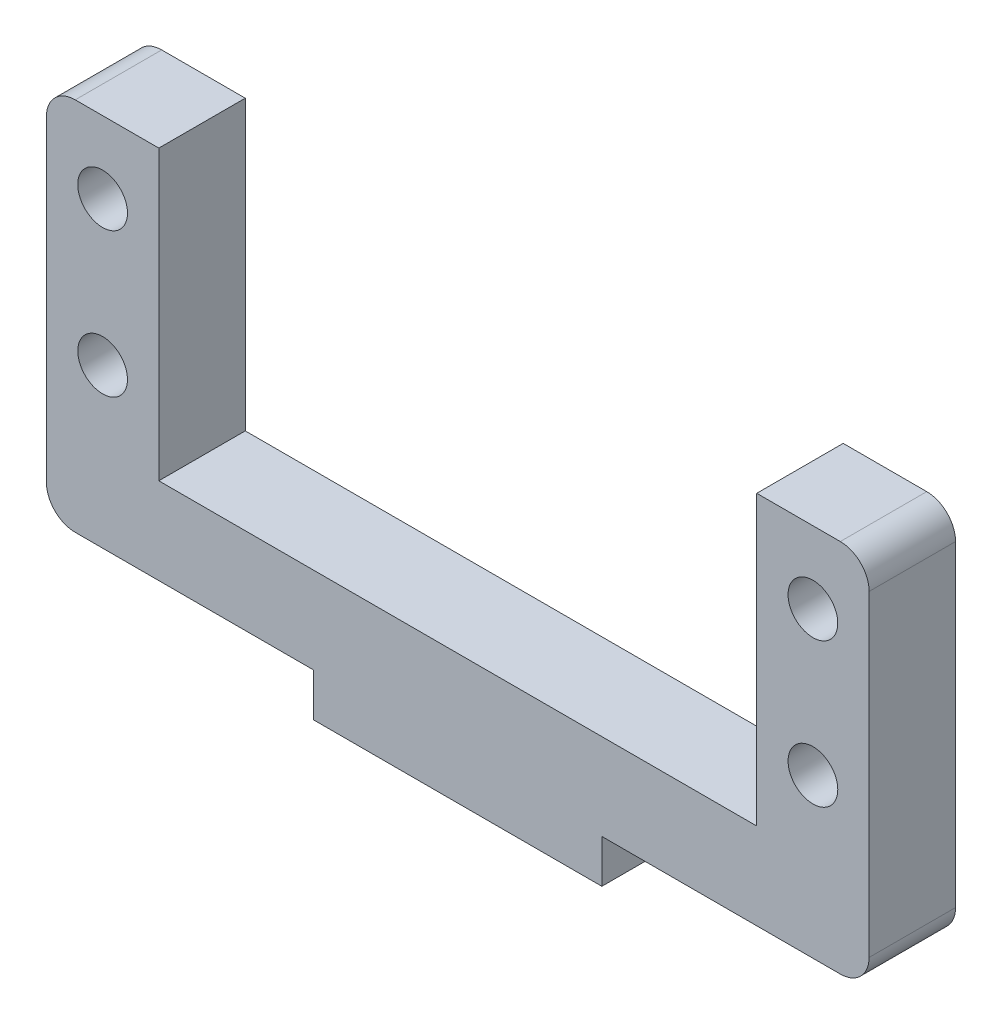
ISO-10303-21;
HEADER;
FILE_DESCRIPTION(('STEP AP214'),'2;1');
FILE_NAME('part.step','',(''),(''),'','','');
FILE_SCHEMA(('AUTOMOTIVE_DESIGN { 1 0 10303 214 1 1 1 1 }'));
ENDSEC;
DATA;
#1=APPLICATION_CONTEXT('core data for automotive mechanical design processes');
#2=APPLICATION_PROTOCOL_DEFINITION('international standard','automotive_design',2000,#1);
#3=PRODUCT_CONTEXT('',#1,'mechanical');
#4=PRODUCT('Part','Part','',(#3));
#5=PRODUCT_RELATED_PRODUCT_CATEGORY('part','',(#4));
#6=PRODUCT_DEFINITION_FORMATION('','',#4);
#7=PRODUCT_DEFINITION_CONTEXT('part definition',#1,'design');
#8=PRODUCT_DEFINITION('design','',#6,#7);
#9=PRODUCT_DEFINITION_SHAPE('','',#8);
#10=(LENGTH_UNIT() NAMED_UNIT(*) SI_UNIT(.MILLI.,.METRE.));
#11=(NAMED_UNIT(*) PLANE_ANGLE_UNIT() SI_UNIT($,.RADIAN.));
#12=(NAMED_UNIT(*) SI_UNIT($,.STERADIAN.) SOLID_ANGLE_UNIT());
#13=UNCERTAINTY_MEASURE_WITH_UNIT(LENGTH_MEASURE(1.E-05),#10,'distance_accuracy_value','');
#14=(GEOMETRIC_REPRESENTATION_CONTEXT(3) GLOBAL_UNCERTAINTY_ASSIGNED_CONTEXT((#13)) GLOBAL_UNIT_ASSIGNED_CONTEXT((#10,
#11,#12)) REPRESENTATION_CONTEXT('',''));
#15=CARTESIAN_POINT('',(0.,0.,0.));
#16=DIRECTION('',(0.,0.,1.));
#17=DIRECTION('',(1.,0.,0.));
#18=AXIS2_PLACEMENT_3D('',#15,#16,#17);
#19=CARTESIAN_POINT('',(0.,0.,6.));
#20=DIRECTION('',(0.,0.,1.));
#21=DIRECTION('',(1.,0.,0.));
#22=AXIS2_PLACEMENT_3D('',#19,#20,#21);
#23=PLANE('',#22);
#24=CARTESIAN_POINT('',(24.65,14.,6.));
#25=DIRECTION('',(0.,0.,1.));
#26=DIRECTION('',(1.,0.,0.));
#27=AXIS2_PLACEMENT_3D('',#24,#25,#26);
#28=CIRCLE('',#27,1.725);
#29=CARTESIAN_POINT('',(26.375,14.,6.));
#30=VERTEX_POINT('',#29);
#31=EDGE_CURVE('E299',#30,#30,#28,.T.);
#32=ORIENTED_EDGE('',*,*,#31,.F.);
#33=EDGE_LOOP('',(#32));
#34=FACE_BOUND('',#33,.T.);
#35=CARTESIAN_POINT('',(-24.65,24.,6.));
#36=DIRECTION('',(0.,0.,1.));
#37=DIRECTION('',(1.,0.,0.));
#38=AXIS2_PLACEMENT_3D('',#35,#36,#37);
#39=CIRCLE('',#38,1.725);
#40=CARTESIAN_POINT('',(-22.925,24.,6.));
#41=VERTEX_POINT('',#40);
#42=EDGE_CURVE('E274',#41,#41,#39,.T.);
#43=ORIENTED_EDGE('',*,*,#42,.F.);
#44=EDGE_LOOP('',(#43));
#45=FACE_BOUND('',#44,.T.);
#46=DIRECTION('',(-1.,0.,0.));
#47=VECTOR('',#46,1.);
#48=CARTESIAN_POINT('',(-28.55,29.,6.));
#49=LINE('',#48,#47);
#50=CARTESIAN_POINT('',(-20.75,29.,6.));
#51=VERTEX_POINT('',#50);
#52=CARTESIAN_POINT('',(-26.55,29.,6.));
#53=VERTEX_POINT('',#52);
#54=EDGE_CURVE('E278',#51,#53,#49,.T.);
#55=ORIENTED_EDGE('',*,*,#54,.T.);
#56=CARTESIAN_POINT('',(-26.55,27.,6.));
#57=DIRECTION('',(0.,0.,1.));
#58=DIRECTION('',(1.,0.,0.));
#59=AXIS2_PLACEMENT_3D('',#56,#57,#58);
#60=CIRCLE('',#59,2.);
#61=CARTESIAN_POINT('',(-28.55,27.,6.));
#62=VERTEX_POINT('',#61);
#63=EDGE_CURVE('E197',#53,#62,#60,.T.);
#64=ORIENTED_EDGE('',*,*,#63,.T.);
#65=DIRECTION('',(0.,-1.,0.));
#66=VECTOR('',#65,1.);
#67=CARTESIAN_POINT('',(-28.55,3.,6.));
#68=LINE('',#67,#66);
#69=CARTESIAN_POINT('',(-28.55,4.99999999999999,6.));
#70=VERTEX_POINT('',#69);
#71=EDGE_CURVE('E276',#62,#70,#68,.T.);
#72=ORIENTED_EDGE('',*,*,#71,.T.);
#73=CARTESIAN_POINT('',(-26.55,5.,6.));
#74=DIRECTION('',(0.,0.,1.));
#75=DIRECTION('',(1.,0.,0.));
#76=AXIS2_PLACEMENT_3D('',#73,#74,#75);
#77=CIRCLE('',#76,2.);
#78=CARTESIAN_POINT('',(-26.55,3.,6.));
#79=VERTEX_POINT('',#78);
#80=EDGE_CURVE('E50',#70,#79,#77,.T.);
#81=ORIENTED_EDGE('',*,*,#80,.T.);
#82=DIRECTION('',(1.,0.,0.));
#83=VECTOR('',#82,1.);
#84=CARTESIAN_POINT('',(-10.,3.,6.));
#85=LINE('',#84,#83);
#86=CARTESIAN_POINT('',(-10.,3.,6.));
#87=VERTEX_POINT('',#86);
#88=EDGE_CURVE('E164',#79,#87,#85,.T.);
#89=ORIENTED_EDGE('',*,*,#88,.T.);
#90=DIRECTION('',(0.,-1.,0.));
#91=VECTOR('',#90,1.);
#92=CARTESIAN_POINT('',(-10.,0.,6.));
#93=LINE('',#92,#91);
#94=CARTESIAN_POINT('',(-10.,0.,6.));
#95=VERTEX_POINT('',#94);
#96=EDGE_CURVE('E159',#87,#95,#93,.T.);
#97=ORIENTED_EDGE('',*,*,#96,.T.);
#98=DIRECTION('',(1.,0.,0.));
#99=VECTOR('',#98,1.);
#100=CARTESIAN_POINT('',(-10.,0.,6.));
#101=LINE('',#100,#99);
#102=CARTESIAN_POINT('',(10.,0.,6.));
#103=VERTEX_POINT('',#102);
#104=EDGE_CURVE('E149',#95,#103,#101,.T.);
#105=ORIENTED_EDGE('',*,*,#104,.T.);
#106=DIRECTION('',(0.,1.,0.));
#107=VECTOR('',#106,1.);
#108=CARTESIAN_POINT('',(10.,0.,6.));
#109=LINE('',#108,#107);
#110=CARTESIAN_POINT('',(10.,3.,6.));
#111=VERTEX_POINT('',#110);
#112=EDGE_CURVE('E158',#103,#111,#109,.T.);
#113=ORIENTED_EDGE('',*,*,#112,.T.);
#114=DIRECTION('',(1.,0.,0.));
#115=VECTOR('',#114,1.);
#116=CARTESIAN_POINT('',(10.,3.,6.));
#117=LINE('',#116,#115);
#118=CARTESIAN_POINT('',(26.55,3.,6.));
#119=VERTEX_POINT('',#118);
#120=EDGE_CURVE('E213',#111,#119,#117,.T.);
#121=ORIENTED_EDGE('',*,*,#120,.T.);
#122=CARTESIAN_POINT('',(26.55,5.,6.));
#123=DIRECTION('',(0.,0.,1.));
#124=DIRECTION('',(1.,0.,0.));
#125=AXIS2_PLACEMENT_3D('',#122,#123,#124);
#126=CIRCLE('',#125,2.);
#127=CARTESIAN_POINT('',(28.55,4.99999999999999,6.));
#128=VERTEX_POINT('',#127);
#129=EDGE_CURVE('E194',#119,#128,#126,.T.);
#130=ORIENTED_EDGE('',*,*,#129,.T.);
#131=DIRECTION('',(0.,1.,0.));
#132=VECTOR('',#131,1.);
#133=CARTESIAN_POINT('',(28.55,3.,6.));
#134=LINE('',#133,#132);
#135=CARTESIAN_POINT('',(28.55,27.,6.));
#136=VERTEX_POINT('',#135);
#137=EDGE_CURVE('E220',#128,#136,#134,.T.);
#138=ORIENTED_EDGE('',*,*,#137,.T.);
#139=CARTESIAN_POINT('',(26.55,27.,6.));
#140=DIRECTION('',(0.,0.,1.));
#141=DIRECTION('',(1.,0.,0.));
#142=AXIS2_PLACEMENT_3D('',#139,#140,#141);
#143=CIRCLE('',#142,2.);
#144=CARTESIAN_POINT('',(26.55,29.,6.));
#145=VERTEX_POINT('',#144);
#146=EDGE_CURVE('E57',#136,#145,#143,.T.);
#147=ORIENTED_EDGE('',*,*,#146,.T.);
#148=DIRECTION('',(-1.,0.,0.));
#149=VECTOR('',#148,1.);
#150=CARTESIAN_POINT('',(28.55,29.,6.));
#151=LINE('',#150,#149);
#152=CARTESIAN_POINT('',(20.75,29.,6.));
#153=VERTEX_POINT('',#152);
#154=EDGE_CURVE('E286',#145,#153,#151,.T.);
#155=ORIENTED_EDGE('',*,*,#154,.T.);
#156=DIRECTION('',(0.,-1.,0.));
#157=VECTOR('',#156,1.);
#158=CARTESIAN_POINT('',(20.75,29.,6.));
#159=LINE('',#158,#157);
#160=CARTESIAN_POINT('',(20.75,9.,6.));
#161=VERTEX_POINT('',#160);
#162=EDGE_CURVE('E284',#153,#161,#159,.T.);
#163=ORIENTED_EDGE('',*,*,#162,.T.);
#164=DIRECTION('',(-1.,0.,0.));
#165=VECTOR('',#164,1.);
#166=CARTESIAN_POINT('',(-20.75,9.,6.));
#167=LINE('',#166,#165);
#168=CARTESIAN_POINT('',(-20.75,9.,6.));
#169=VERTEX_POINT('',#168);
#170=EDGE_CURVE('E282',#161,#169,#167,.T.);
#171=ORIENTED_EDGE('',*,*,#170,.T.);
#172=DIRECTION('',(0.,1.,0.));
#173=VECTOR('',#172,1.);
#174=CARTESIAN_POINT('',(-20.75,29.,6.));
#175=LINE('',#174,#173);
#176=EDGE_CURVE('E280',#169,#51,#175,.T.);
#177=ORIENTED_EDGE('',*,*,#176,.T.);
#178=EDGE_LOOP('',(#55,#64,#72,#81,#89,#97,#105,#113,#121,#130,#138,#147,#155,#163,#171,#177));
#179=FACE_BOUND('',#178,.T.);
#180=CARTESIAN_POINT('',(-24.65,14.,6.));
#181=DIRECTION('',(0.,0.,1.));
#182=DIRECTION('',(-1.,0.,0.));
#183=AXIS2_PLACEMENT_3D('',#180,#181,#182);
#184=CIRCLE('',#183,1.725);
#185=CARTESIAN_POINT('',(-26.375,14.,6.));
#186=VERTEX_POINT('',#185);
#187=EDGE_CURVE('E293',#186,#186,#184,.T.);
#188=ORIENTED_EDGE('',*,*,#187,.F.);
#189=EDGE_LOOP('',(#188));
#190=FACE_BOUND('',#189,.T.);
#191=CARTESIAN_POINT('',(24.65,24.,6.));
#192=DIRECTION('',(0.,0.,1.));
#193=DIRECTION('',(-1.,0.,0.));
#194=AXIS2_PLACEMENT_3D('',#191,#192,#193);
#195=CIRCLE('',#194,1.725);
#196=CARTESIAN_POINT('',(22.925,24.,6.));
#197=VERTEX_POINT('',#196);
#198=EDGE_CURVE('E305',#197,#197,#195,.T.);
#199=ORIENTED_EDGE('',*,*,#198,.F.);
#200=EDGE_LOOP('',(#199));
#201=FACE_BOUND('',#200,.T.);
#202=ADVANCED_FACE('F35',(#34,#45,#179,#190,#201),#23,.T.);
#203=CARTESIAN_POINT('',(0.,0.,0.));
#204=DIRECTION('',(0.,0.,1.));
#205=DIRECTION('',(1.,0.,0.));
#206=AXIS2_PLACEMENT_3D('',#203,#204,#205);
#207=PLANE('',#206);
#208=CARTESIAN_POINT('',(24.65,14.,0.));
#209=DIRECTION('',(0.,0.,1.));
#210=DIRECTION('',(1.,0.,0.));
#211=AXIS2_PLACEMENT_3D('',#208,#209,#210);
#212=CIRCLE('',#211,1.725);
#213=CARTESIAN_POINT('',(26.375,14.,0.));
#214=VERTEX_POINT('',#213);
#215=EDGE_CURVE('E302',#214,#214,#212,.T.);
#216=ORIENTED_EDGE('',*,*,#215,.T.);
#217=EDGE_LOOP('',(#216));
#218=FACE_BOUND('',#217,.T.);
#219=CARTESIAN_POINT('',(-24.65,24.,0.));
#220=DIRECTION('',(0.,0.,1.));
#221=DIRECTION('',(1.,0.,0.));
#222=AXIS2_PLACEMENT_3D('',#219,#220,#221);
#223=CIRCLE('',#222,1.725);
#224=CARTESIAN_POINT('',(-22.925,24.,0.));
#225=VERTEX_POINT('',#224);
#226=EDGE_CURVE('E290',#225,#225,#223,.T.);
#227=ORIENTED_EDGE('',*,*,#226,.T.);
#228=EDGE_LOOP('',(#227));
#229=FACE_BOUND('',#228,.T.);
#230=DIRECTION('',(0.,-1.,0.));
#231=VECTOR('',#230,1.);
#232=CARTESIAN_POINT('',(-28.55,3.,0.));
#233=LINE('',#232,#231);
#234=CARTESIAN_POINT('',(-28.55,27.,0.));
#235=VERTEX_POINT('',#234);
#236=CARTESIAN_POINT('',(-28.55,4.99999999999999,0.));
#237=VERTEX_POINT('',#236);
#238=EDGE_CURVE('E251',#235,#237,#233,.T.);
#239=ORIENTED_EDGE('',*,*,#238,.F.);
#240=CARTESIAN_POINT('',(-26.55,27.,0.));
#241=DIRECTION('',(0.,0.,1.));
#242=DIRECTION('',(1.,0.,0.));
#243=AXIS2_PLACEMENT_3D('',#240,#241,#242);
#244=CIRCLE('',#243,2.);
#245=CARTESIAN_POINT('',(-26.55,29.,0.));
#246=VERTEX_POINT('',#245);
#247=EDGE_CURVE('E189',#235,#246,#244,.F.);
#248=ORIENTED_EDGE('',*,*,#247,.T.);
#249=DIRECTION('',(-1.,0.,0.));
#250=VECTOR('',#249,1.);
#251=CARTESIAN_POINT('',(-28.55,29.,0.));
#252=LINE('',#251,#250);
#253=CARTESIAN_POINT('',(-20.75,29.,0.));
#254=VERTEX_POINT('',#253);
#255=EDGE_CURVE('E248',#254,#246,#252,.T.);
#256=ORIENTED_EDGE('',*,*,#255,.F.);
#257=DIRECTION('',(0.,1.,0.));
#258=VECTOR('',#257,1.);
#259=CARTESIAN_POINT('',(-20.75,29.,0.));
#260=LINE('',#259,#258);
#261=CARTESIAN_POINT('',(-20.75,9.,0.));
#262=VERTEX_POINT('',#261);
#263=EDGE_CURVE('E246',#262,#254,#260,.T.);
#264=ORIENTED_EDGE('',*,*,#263,.F.);
#265=DIRECTION('',(-1.,0.,0.));
#266=VECTOR('',#265,1.);
#267=CARTESIAN_POINT('',(-20.75,9.,0.));
#268=LINE('',#267,#266);
#269=CARTESIAN_POINT('',(20.75,9.,0.));
#270=VERTEX_POINT('',#269);
#271=EDGE_CURVE('E244',#270,#262,#268,.T.);
#272=ORIENTED_EDGE('',*,*,#271,.F.);
#273=DIRECTION('',(0.,-1.,0.));
#274=VECTOR('',#273,1.);
#275=CARTESIAN_POINT('',(20.75,29.,0.));
#276=LINE('',#275,#274);
#277=CARTESIAN_POINT('',(20.75,29.,0.));
#278=VERTEX_POINT('',#277);
#279=EDGE_CURVE('E237',#278,#270,#276,.T.);
#280=ORIENTED_EDGE('',*,*,#279,.F.);
#281=DIRECTION('',(-1.,0.,0.));
#282=VECTOR('',#281,1.);
#283=CARTESIAN_POINT('',(28.55,29.,0.));
#284=LINE('',#283,#282);
#285=CARTESIAN_POINT('',(26.55,29.,0.));
#286=VERTEX_POINT('',#285);
#287=EDGE_CURVE('E235',#286,#278,#284,.T.);
#288=ORIENTED_EDGE('',*,*,#287,.F.);
#289=CARTESIAN_POINT('',(26.55,27.,0.));
#290=DIRECTION('',(0.,0.,1.));
#291=DIRECTION('',(1.,0.,0.));
#292=AXIS2_PLACEMENT_3D('',#289,#290,#291);
#293=CIRCLE('',#292,2.);
#294=CARTESIAN_POINT('',(28.55,27.,0.));
#295=VERTEX_POINT('',#294);
#296=EDGE_CURVE('E187',#286,#295,#293,.F.);
#297=ORIENTED_EDGE('',*,*,#296,.T.);
#298=DIRECTION('',(0.,1.,0.));
#299=VECTOR('',#298,1.);
#300=CARTESIAN_POINT('',(28.55,3.,0.));
#301=LINE('',#300,#299);
#302=CARTESIAN_POINT('',(28.55,4.99999999999999,0.));
#303=VERTEX_POINT('',#302);
#304=EDGE_CURVE('E228',#303,#295,#301,.T.);
#305=ORIENTED_EDGE('',*,*,#304,.F.);
#306=CARTESIAN_POINT('',(26.55,5.,0.));
#307=DIRECTION('',(0.,0.,1.));
#308=DIRECTION('',(1.,0.,0.));
#309=AXIS2_PLACEMENT_3D('',#306,#307,#308);
#310=CIRCLE('',#309,2.);
#311=CARTESIAN_POINT('',(26.55,3.,0.));
#312=VERTEX_POINT('',#311);
#313=EDGE_CURVE('E185',#303,#312,#310,.F.);
#314=ORIENTED_EDGE('',*,*,#313,.T.);
#315=DIRECTION('',(1.,0.,0.));
#316=VECTOR('',#315,1.);
#317=CARTESIAN_POINT('',(10.,3.,0.));
#318=LINE('',#317,#316);
#319=CARTESIAN_POINT('',(10.,3.,0.));
#320=VERTEX_POINT('',#319);
#321=EDGE_CURVE('E215',#320,#312,#318,.T.);
#322=ORIENTED_EDGE('',*,*,#321,.F.);
#323=DIRECTION('',(0.,1.,0.));
#324=VECTOR('',#323,1.);
#325=CARTESIAN_POINT('',(10.,0.,0.));
#326=LINE('',#325,#324);
#327=CARTESIAN_POINT('',(10.,0.,0.));
#328=VERTEX_POINT('',#327);
#329=EDGE_CURVE('E239',#328,#320,#326,.T.);
#330=ORIENTED_EDGE('',*,*,#329,.F.);
#331=DIRECTION('',(1.,0.,0.));
#332=VECTOR('',#331,1.);
#333=CARTESIAN_POINT('',(-10.,0.,0.));
#334=LINE('',#333,#332);
#335=CARTESIAN_POINT('',(-10.,0.,0.));
#336=VERTEX_POINT('',#335);
#337=EDGE_CURVE('E270',#336,#328,#334,.T.);
#338=ORIENTED_EDGE('',*,*,#337,.F.);
#339=DIRECTION('',(0.,-1.,0.));
#340=VECTOR('',#339,1.);
#341=CARTESIAN_POINT('',(-10.,0.,0.));
#342=LINE('',#341,#340);
#343=CARTESIAN_POINT('',(-10.,3.,0.));
#344=VERTEX_POINT('',#343);
#345=EDGE_CURVE('E172',#344,#336,#342,.T.);
#346=ORIENTED_EDGE('',*,*,#345,.F.);
#347=DIRECTION('',(1.,0.,0.));
#348=VECTOR('',#347,1.);
#349=CARTESIAN_POINT('',(-10.,3.,0.));
#350=LINE('',#349,#348);
#351=CARTESIAN_POINT('',(-26.55,3.,0.));
#352=VERTEX_POINT('',#351);
#353=EDGE_CURVE('E168',#352,#344,#350,.T.);
#354=ORIENTED_EDGE('',*,*,#353,.F.);
#355=CARTESIAN_POINT('',(-26.55,5.,0.));
#356=DIRECTION('',(0.,0.,1.));
#357=DIRECTION('',(1.,0.,0.));
#358=AXIS2_PLACEMENT_3D('',#355,#356,#357);
#359=CIRCLE('',#358,2.);
#360=EDGE_CURVE('E183',#352,#237,#359,.F.);
#361=ORIENTED_EDGE('',*,*,#360,.T.);
#362=EDGE_LOOP('',(#239,#248,#256,#264,#272,#280,#288,#297,#305,#314,#322,#330,#338,#346,#354,#361));
#363=FACE_BOUND('',#362,.T.);
#364=CARTESIAN_POINT('',(-24.65,14.,0.));
#365=DIRECTION('',(0.,0.,1.));
#366=DIRECTION('',(-1.,0.,0.));
#367=AXIS2_PLACEMENT_3D('',#364,#365,#366);
#368=CIRCLE('',#367,1.725);
#369=CARTESIAN_POINT('',(-26.375,14.,0.));
#370=VERTEX_POINT('',#369);
#371=EDGE_CURVE('E296',#370,#370,#368,.T.);
#372=ORIENTED_EDGE('',*,*,#371,.T.);
#373=EDGE_LOOP('',(#372));
#374=FACE_BOUND('',#373,.T.);
#375=CARTESIAN_POINT('',(24.65,24.,0.));
#376=DIRECTION('',(0.,0.,1.));
#377=DIRECTION('',(-1.,0.,0.));
#378=AXIS2_PLACEMENT_3D('',#375,#376,#377);
#379=CIRCLE('',#378,1.725);
#380=CARTESIAN_POINT('',(22.925,24.,0.));
#381=VERTEX_POINT('',#380);
#382=EDGE_CURVE('E308',#381,#381,#379,.T.);
#383=ORIENTED_EDGE('',*,*,#382,.T.);
#384=EDGE_LOOP('',(#383));
#385=FACE_BOUND('',#384,.T.);
#386=ADVANCED_FACE('F232',(#218,#229,#363,#374,#385),#207,.F.);
#387=CARTESIAN_POINT('',(-10.,0.,6.));
#388=DIRECTION('',(1.,0.,0.));
#389=DIRECTION('',(0.,0.,-1.));
#390=AXIS2_PLACEMENT_3D('',#387,#388,#389);
#391=PLANE('',#390);
#392=ORIENTED_EDGE('',*,*,#345,.T.);
#393=DIRECTION('',(0.,0.,-1.));
#394=VECTOR('',#393,1.);
#395=CARTESIAN_POINT('',(-10.,0.,6.));
#396=LINE('',#395,#394);
#397=EDGE_CURVE('E153',#95,#336,#396,.T.);
#398=ORIENTED_EDGE('',*,*,#397,.F.);
#399=ORIENTED_EDGE('',*,*,#96,.F.);
#400=DIRECTION('',(0.,0.,-1.));
#401=VECTOR('',#400,1.);
#402=CARTESIAN_POINT('',(-10.,3.,6.));
#403=LINE('',#402,#401);
#404=EDGE_CURVE('E255',#87,#344,#403,.T.);
#405=ORIENTED_EDGE('',*,*,#404,.T.);
#406=EDGE_LOOP('',(#392,#398,#399,#405));
#407=FACE_BOUND('',#406,.T.);
#408=ADVANCED_FACE('F170',(#407),#391,.F.);
#409=CARTESIAN_POINT('',(-10.,0.,6.));
#410=DIRECTION('',(0.,1.,0.));
#411=DIRECTION('',(0.,0.,1.));
#412=AXIS2_PLACEMENT_3D('',#409,#410,#411);
#413=PLANE('',#412);
#414=ORIENTED_EDGE('',*,*,#337,.T.);
#415=DIRECTION('',(0.,0.,-1.));
#416=VECTOR('',#415,1.);
#417=CARTESIAN_POINT('',(10.,0.,6.));
#418=LINE('',#417,#416);
#419=EDGE_CURVE('E156',#103,#328,#418,.T.);
#420=ORIENTED_EDGE('',*,*,#419,.F.);
#421=ORIENTED_EDGE('',*,*,#104,.F.);
#422=ORIENTED_EDGE('',*,*,#397,.T.);
#423=EDGE_LOOP('',(#414,#420,#421,#422));
#424=FACE_BOUND('',#423,.T.);
#425=ADVANCED_FACE('F151',(#424),#413,.F.);
#426=CARTESIAN_POINT('',(10.,0.,6.));
#427=DIRECTION('',(-1.,0.,0.));
#428=DIRECTION('',(0.,0.,1.));
#429=AXIS2_PLACEMENT_3D('',#426,#427,#428);
#430=PLANE('',#429);
#431=ORIENTED_EDGE('',*,*,#329,.T.);
#432=DIRECTION('',(0.,0.,-1.));
#433=VECTOR('',#432,1.);
#434=CARTESIAN_POINT('',(10.,3.,6.));
#435=LINE('',#434,#433);
#436=EDGE_CURVE('E177',#111,#320,#435,.T.);
#437=ORIENTED_EDGE('',*,*,#436,.F.);
#438=ORIENTED_EDGE('',*,*,#112,.F.);
#439=ORIENTED_EDGE('',*,*,#419,.T.);
#440=EDGE_LOOP('',(#431,#437,#438,#439));
#441=FACE_BOUND('',#440,.T.);
#442=ADVANCED_FACE('F363',(#441),#430,.F.);
#443=CARTESIAN_POINT('',(10.,3.,6.));
#444=DIRECTION('',(0.,1.,0.));
#445=DIRECTION('',(-1.,0.,0.));
#446=AXIS2_PLACEMENT_3D('',#443,#444,#445);
#447=PLANE('',#446);
#448=ORIENTED_EDGE('',*,*,#321,.T.);
#449=DIRECTION('',(0.,0.,-1.));
#450=VECTOR('',#449,1.);
#451=CARTESIAN_POINT('',(26.55,3.,6.));
#452=LINE('',#451,#450);
#453=EDGE_CURVE('E43',#312,#119,#452,.F.);
#454=ORIENTED_EDGE('',*,*,#453,.T.);
#455=ORIENTED_EDGE('',*,*,#120,.F.);
#456=ORIENTED_EDGE('',*,*,#436,.T.);
#457=EDGE_LOOP('',(#448,#454,#455,#456));
#458=FACE_BOUND('',#457,.T.);
#459=ADVANCED_FACE('F211',(#458),#447,.F.);
#460=CARTESIAN_POINT('',(28.55,3.,6.));
#461=DIRECTION('',(-1.,0.,0.));
#462=DIRECTION('',(0.,0.,1.));
#463=AXIS2_PLACEMENT_3D('',#460,#461,#462);
#464=PLANE('',#463);
#465=ORIENTED_EDGE('',*,*,#304,.T.);
#466=DIRECTION('',(0.,0.,-1.));
#467=VECTOR('',#466,1.);
#468=CARTESIAN_POINT('',(28.55,27.,6.));
#469=LINE('',#468,#467);
#470=EDGE_CURVE('E205',#295,#136,#469,.F.);
#471=ORIENTED_EDGE('',*,*,#470,.T.);
#472=ORIENTED_EDGE('',*,*,#137,.F.);
#473=DIRECTION('',(0.,0.,-1.));
#474=VECTOR('',#473,1.);
#475=CARTESIAN_POINT('',(28.55,5.,6.));
#476=LINE('',#475,#474);
#477=EDGE_CURVE('E202',#128,#303,#476,.T.);
#478=ORIENTED_EDGE('',*,*,#477,.T.);
#479=EDGE_LOOP('',(#465,#471,#472,#478));
#480=FACE_BOUND('',#479,.T.);
#481=ADVANCED_FACE('F227',(#480),#464,.F.);
#482=CARTESIAN_POINT('',(28.55,29.,6.));
#483=DIRECTION('',(0.,-1.,0.));
#484=DIRECTION('',(0.,0.,-1.));
#485=AXIS2_PLACEMENT_3D('',#482,#483,#484);
#486=PLANE('',#485);
#487=ORIENTED_EDGE('',*,*,#154,.F.);
#488=DIRECTION('',(0.,0.,-1.));
#489=VECTOR('',#488,1.);
#490=CARTESIAN_POINT('',(26.55,29.,6.));
#491=LINE('',#490,#489);
#492=EDGE_CURVE('E199',#145,#286,#491,.T.);
#493=ORIENTED_EDGE('',*,*,#492,.T.);
#494=ORIENTED_EDGE('',*,*,#287,.T.);
#495=DIRECTION('',(0.,0.,-1.));
#496=VECTOR('',#495,1.);
#497=CARTESIAN_POINT('',(20.75,29.,6.));
#498=LINE('',#497,#496);
#499=EDGE_CURVE('E266',#153,#278,#498,.T.);
#500=ORIENTED_EDGE('',*,*,#499,.F.);
#501=EDGE_LOOP('',(#487,#493,#494,#500));
#502=FACE_BOUND('',#501,.T.);
#503=ADVANCED_FACE('F354',(#502),#486,.F.);
#504=CARTESIAN_POINT('',(20.75,29.,6.));
#505=DIRECTION('',(1.,0.,0.));
#506=DIRECTION('',(0.,1.,0.));
#507=AXIS2_PLACEMENT_3D('',#504,#505,#506);
#508=PLANE('',#507);
#509=ORIENTED_EDGE('',*,*,#279,.T.);
#510=DIRECTION('',(0.,0.,-1.));
#511=VECTOR('',#510,1.);
#512=CARTESIAN_POINT('',(20.75,9.,6.));
#513=LINE('',#512,#511);
#514=EDGE_CURVE('E263',#161,#270,#513,.T.);
#515=ORIENTED_EDGE('',*,*,#514,.F.);
#516=ORIENTED_EDGE('',*,*,#162,.F.);
#517=ORIENTED_EDGE('',*,*,#499,.T.);
#518=EDGE_LOOP('',(#509,#515,#516,#517));
#519=FACE_BOUND('',#518,.T.);
#520=ADVANCED_FACE('F350',(#519),#508,.F.);
#521=CARTESIAN_POINT('',(-20.75,9.,6.));
#522=DIRECTION('',(0.,-1.,0.));
#523=DIRECTION('',(0.,0.,-1.));
#524=AXIS2_PLACEMENT_3D('',#521,#522,#523);
#525=PLANE('',#524);
#526=ORIENTED_EDGE('',*,*,#271,.T.);
#527=DIRECTION('',(0.,0.,-1.));
#528=VECTOR('',#527,1.);
#529=CARTESIAN_POINT('',(-20.75,9.,6.));
#530=LINE('',#529,#528);
#531=EDGE_CURVE('E260',#169,#262,#530,.T.);
#532=ORIENTED_EDGE('',*,*,#531,.F.);
#533=ORIENTED_EDGE('',*,*,#170,.F.);
#534=ORIENTED_EDGE('',*,*,#514,.T.);
#535=EDGE_LOOP('',(#526,#532,#533,#534));
#536=FACE_BOUND('',#535,.T.);
#537=ADVANCED_FACE('F346',(#536),#525,.F.);
#538=CARTESIAN_POINT('',(-20.75,29.,6.));
#539=DIRECTION('',(-1.,0.,0.));
#540=DIRECTION('',(0.,0.,1.));
#541=AXIS2_PLACEMENT_3D('',#538,#539,#540);
#542=PLANE('',#541);
#543=ORIENTED_EDGE('',*,*,#263,.T.);
#544=DIRECTION('',(0.,0.,-1.));
#545=VECTOR('',#544,1.);
#546=CARTESIAN_POINT('',(-20.75,29.,6.));
#547=LINE('',#546,#545);
#548=EDGE_CURVE('E257',#51,#254,#547,.T.);
#549=ORIENTED_EDGE('',*,*,#548,.F.);
#550=ORIENTED_EDGE('',*,*,#176,.F.);
#551=ORIENTED_EDGE('',*,*,#531,.T.);
#552=EDGE_LOOP('',(#543,#549,#550,#551));
#553=FACE_BOUND('',#552,.T.);
#554=ADVANCED_FACE('F342',(#553),#542,.F.);
#555=CARTESIAN_POINT('',(-28.55,29.,6.));
#556=DIRECTION('',(0.,-1.,0.));
#557=DIRECTION('',(0.,0.,-1.));
#558=AXIS2_PLACEMENT_3D('',#555,#556,#557);
#559=PLANE('',#558);
#560=ORIENTED_EDGE('',*,*,#255,.T.);
#561=DIRECTION('',(0.,0.,-1.));
#562=VECTOR('',#561,1.);
#563=CARTESIAN_POINT('',(-26.55,29.,6.));
#564=LINE('',#563,#562);
#565=EDGE_CURVE('E191',#246,#53,#564,.F.);
#566=ORIENTED_EDGE('',*,*,#565,.T.);
#567=ORIENTED_EDGE('',*,*,#54,.F.);
#568=ORIENTED_EDGE('',*,*,#548,.T.);
#569=EDGE_LOOP('',(#560,#566,#567,#568));
#570=FACE_BOUND('',#569,.T.);
#571=ADVANCED_FACE('F338',(#570),#559,.F.);
#572=CARTESIAN_POINT('',(-28.55,3.,6.));
#573=DIRECTION('',(1.,0.,0.));
#574=DIRECTION('',(0.,0.,-1.));
#575=AXIS2_PLACEMENT_3D('',#572,#573,#574);
#576=PLANE('',#575);
#577=ORIENTED_EDGE('',*,*,#71,.F.);
#578=DIRECTION('',(0.,0.,-1.));
#579=VECTOR('',#578,1.);
#580=CARTESIAN_POINT('',(-28.55,27.,6.));
#581=LINE('',#580,#579);
#582=EDGE_CURVE('E175',#62,#235,#581,.T.);
#583=ORIENTED_EDGE('',*,*,#582,.T.);
#584=ORIENTED_EDGE('',*,*,#238,.T.);
#585=DIRECTION('',(0.,0.,-1.));
#586=VECTOR('',#585,1.);
#587=CARTESIAN_POINT('',(-28.55,5.,6.));
#588=LINE('',#587,#586);
#589=EDGE_CURVE('E173',#237,#70,#588,.F.);
#590=ORIENTED_EDGE('',*,*,#589,.T.);
#591=EDGE_LOOP('',(#577,#583,#584,#590));
#592=FACE_BOUND('',#591,.T.);
#593=ADVANCED_FACE('F334',(#592),#576,.F.);
#594=CARTESIAN_POINT('',(-10.,3.,6.));
#595=DIRECTION('',(0.,1.,0.));
#596=DIRECTION('',(-1.,0.,0.));
#597=AXIS2_PLACEMENT_3D('',#594,#595,#596);
#598=PLANE('',#597);
#599=ORIENTED_EDGE('',*,*,#88,.F.);
#600=DIRECTION('',(0.,0.,-1.));
#601=VECTOR('',#600,1.);
#602=CARTESIAN_POINT('',(-26.55,3.,6.));
#603=LINE('',#602,#601);
#604=EDGE_CURVE('E11',#79,#352,#603,.T.);
#605=ORIENTED_EDGE('',*,*,#604,.T.);
#606=ORIENTED_EDGE('',*,*,#353,.T.);
#607=ORIENTED_EDGE('',*,*,#404,.F.);
#608=EDGE_LOOP('',(#599,#605,#606,#607));
#609=FACE_BOUND('',#608,.T.);
#610=ADVANCED_FACE('F331',(#609),#598,.F.);
#611=CARTESIAN_POINT('',(-24.65,24.,6.));
#612=DIRECTION('',(0.,0.,-1.));
#613=DIRECTION('',(-1.,0.,0.));
#614=AXIS2_PLACEMENT_3D('',#611,#612,#613);
#615=CYLINDRICAL_SURFACE('',#614,1.725);
#616=ORIENTED_EDGE('',*,*,#42,.T.);
#617=EDGE_LOOP('',(#616));
#618=FACE_BOUND('',#617,.T.);
#619=ORIENTED_EDGE('',*,*,#226,.F.);
#620=EDGE_LOOP('',(#619));
#621=FACE_BOUND('',#620,.T.);
#622=ADVANCED_FACE('F328',(#618,#621),#615,.F.);
#623=CARTESIAN_POINT('',(-24.65,14.,6.));
#624=DIRECTION('',(0.,0.,-1.));
#625=DIRECTION('',(-1.,0.,0.));
#626=AXIS2_PLACEMENT_3D('',#623,#624,#625);
#627=CYLINDRICAL_SURFACE('',#626,1.725);
#628=ORIENTED_EDGE('',*,*,#187,.T.);
#629=EDGE_LOOP('',(#628));
#630=FACE_BOUND('',#629,.T.);
#631=ORIENTED_EDGE('',*,*,#371,.F.);
#632=EDGE_LOOP('',(#631));
#633=FACE_BOUND('',#632,.T.);
#634=ADVANCED_FACE('F490',(#630,#633),#627,.F.);
#635=CARTESIAN_POINT('',(24.65,14.,6.));
#636=DIRECTION('',(0.,0.,-1.));
#637=DIRECTION('',(-1.,0.,0.));
#638=AXIS2_PLACEMENT_3D('',#635,#636,#637);
#639=CYLINDRICAL_SURFACE('',#638,1.725);
#640=ORIENTED_EDGE('',*,*,#31,.T.);
#641=EDGE_LOOP('',(#640));
#642=FACE_BOUND('',#641,.T.);
#643=ORIENTED_EDGE('',*,*,#215,.F.);
#644=EDGE_LOOP('',(#643));
#645=FACE_BOUND('',#644,.T.);
#646=ADVANCED_FACE('F481',(#642,#645),#639,.F.);
#647=CARTESIAN_POINT('',(24.65,24.,6.));
#648=DIRECTION('',(0.,0.,-1.));
#649=DIRECTION('',(-1.,0.,0.));
#650=AXIS2_PLACEMENT_3D('',#647,#648,#649);
#651=CYLINDRICAL_SURFACE('',#650,1.725);
#652=ORIENTED_EDGE('',*,*,#198,.T.);
#653=EDGE_LOOP('',(#652));
#654=FACE_BOUND('',#653,.T.);
#655=ORIENTED_EDGE('',*,*,#382,.F.);
#656=EDGE_LOOP('',(#655));
#657=FACE_BOUND('',#656,.T.);
#658=ADVANCED_FACE('F314',(#654,#657),#651,.F.);
#659=CARTESIAN_POINT('',(-26.55,27.,6.));
#660=DIRECTION('',(0.,0.,-1.));
#661=DIRECTION('',(-1.,0.,0.));
#662=AXIS2_PLACEMENT_3D('',#659,#660,#661);
#663=CYLINDRICAL_SURFACE('',#662,2.);
#664=ORIENTED_EDGE('',*,*,#63,.F.);
#665=ORIENTED_EDGE('',*,*,#565,.F.);
#666=ORIENTED_EDGE('',*,*,#247,.F.);
#667=ORIENTED_EDGE('',*,*,#582,.F.);
#668=EDGE_LOOP('',(#664,#665,#666,#667));
#669=FACE_BOUND('',#668,.T.);
#670=ADVANCED_FACE('F370',(#669),#663,.T.);
#671=CARTESIAN_POINT('',(26.55,27.,6.));
#672=DIRECTION('',(0.,0.,-1.));
#673=DIRECTION('',(-1.,0.,0.));
#674=AXIS2_PLACEMENT_3D('',#671,#672,#673);
#675=CYLINDRICAL_SURFACE('',#674,2.);
#676=ORIENTED_EDGE('',*,*,#146,.F.);
#677=ORIENTED_EDGE('',*,*,#470,.F.);
#678=ORIENTED_EDGE('',*,*,#296,.F.);
#679=ORIENTED_EDGE('',*,*,#492,.F.);
#680=EDGE_LOOP('',(#676,#677,#678,#679));
#681=FACE_BOUND('',#680,.T.);
#682=ADVANCED_FACE('F373',(#681),#675,.T.);
#683=CARTESIAN_POINT('',(26.55,5.,6.));
#684=DIRECTION('',(0.,0.,-1.));
#685=DIRECTION('',(-1.,0.,0.));
#686=AXIS2_PLACEMENT_3D('',#683,#684,#685);
#687=CYLINDRICAL_SURFACE('',#686,2.);
#688=ORIENTED_EDGE('',*,*,#129,.F.);
#689=ORIENTED_EDGE('',*,*,#453,.F.);
#690=ORIENTED_EDGE('',*,*,#313,.F.);
#691=ORIENTED_EDGE('',*,*,#477,.F.);
#692=EDGE_LOOP('',(#688,#689,#690,#691));
#693=FACE_BOUND('',#692,.T.);
#694=ADVANCED_FACE('F223',(#693),#687,.T.);
#695=CARTESIAN_POINT('',(-26.55,5.,6.));
#696=DIRECTION('',(0.,0.,-1.));
#697=DIRECTION('',(-1.,0.,0.));
#698=AXIS2_PLACEMENT_3D('',#695,#696,#697);
#699=CYLINDRICAL_SURFACE('',#698,2.);
#700=ORIENTED_EDGE('',*,*,#80,.F.);
#701=ORIENTED_EDGE('',*,*,#589,.F.);
#702=ORIENTED_EDGE('',*,*,#360,.F.);
#703=ORIENTED_EDGE('',*,*,#604,.F.);
#704=EDGE_LOOP('',(#700,#701,#702,#703));
#705=FACE_BOUND('',#704,.T.);
#706=ADVANCED_FACE('F37',(#705),#699,.T.);
#707=CLOSED_SHELL('',(#202,#386,#408,#425,#442,#459,#481,#503,#520,#537,#554,#571,#593,#610,
#622,#634,#646,#658,#670,#682,#694,#706));
#708=MANIFOLD_SOLID_BREP('B2',#707);
#709=ADVANCED_BREP_SHAPE_REPRESENTATION('',(#18,#708),#14);
#710=SHAPE_DEFINITION_REPRESENTATION(#9,#709);
ENDSEC;
END-ISO-10303-21;
